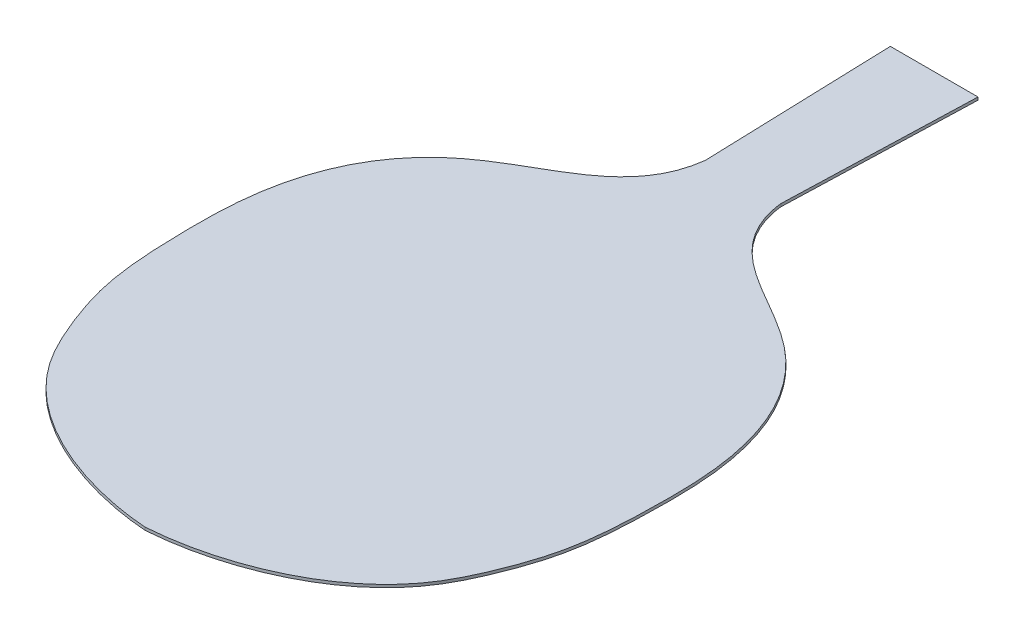
ISO-10303-21;
HEADER;
FILE_DESCRIPTION(('STEP AP214'),'2;1');
FILE_NAME('part.step','',(''),(''),'','','');
FILE_SCHEMA(('AUTOMOTIVE_DESIGN { 1 0 10303 214 1 1 1 1 }'));
ENDSEC;
DATA;
#1=APPLICATION_CONTEXT('core data for automotive mechanical design processes');
#2=APPLICATION_PROTOCOL_DEFINITION('international standard','automotive_design',2000,#1);
#3=PRODUCT_CONTEXT('',#1,'mechanical');
#4=PRODUCT('Part','Part','',(#3));
#5=PRODUCT_RELATED_PRODUCT_CATEGORY('part','',(#4));
#6=PRODUCT_DEFINITION_FORMATION('','',#4);
#7=PRODUCT_DEFINITION_CONTEXT('part definition',#1,'design');
#8=PRODUCT_DEFINITION('design','',#6,#7);
#9=PRODUCT_DEFINITION_SHAPE('','',#8);
#10=(LENGTH_UNIT() NAMED_UNIT(*) SI_UNIT(.MILLI.,.METRE.));
#11=(NAMED_UNIT(*) PLANE_ANGLE_UNIT() SI_UNIT($,.RADIAN.));
#12=(NAMED_UNIT(*) SI_UNIT($,.STERADIAN.) SOLID_ANGLE_UNIT());
#13=UNCERTAINTY_MEASURE_WITH_UNIT(LENGTH_MEASURE(1.E-05),#10,'distance_accuracy_value','');
#14=(GEOMETRIC_REPRESENTATION_CONTEXT(3) GLOBAL_UNCERTAINTY_ASSIGNED_CONTEXT((#13)) GLOBAL_UNIT_ASSIGNED_CONTEXT((#10,
#11,#12)) REPRESENTATION_CONTEXT('',''));
#15=CARTESIAN_POINT('',(0.,0.,0.));
#16=DIRECTION('',(0.,0.,1.));
#17=DIRECTION('',(1.,0.,0.));
#18=AXIS2_PLACEMENT_3D('',#15,#16,#17);
#19=CARTESIAN_POINT('',(-14.,0.9,-126.));
#20=DIRECTION('',(0.999468760107714,0.,-0.0325913726122081));
#21=DIRECTION('',(-0.0325913726122081,0.,-0.999468760107715));
#22=AXIS2_PLACEMENT_3D('',#19,#20,#21);
#23=PLANE('',#22);
#24=DIRECTION('',(0.0325913726122081,0.,0.999468760107714));
#25=VECTOR('',#24,1.);
#26=CARTESIAN_POINT('',(-14.,0.,-126.));
#27=LINE('',#26,#25);
#28=CARTESIAN_POINT('',(-14.,0.,-126.));
#29=VERTEX_POINT('',#28);
#30=CARTESIAN_POINT('',(-12.0108695652174,0.,-65.0000000000001));
#31=VERTEX_POINT('',#30);
#32=EDGE_CURVE('E122',#29,#31,#27,.T.);
#33=ORIENTED_EDGE('',*,*,#32,.T.);
#34=DIRECTION('',(0.,-1.,0.));
#35=VECTOR('',#34,1.);
#36=CARTESIAN_POINT('',(-12.0108695652174,0.9,-65.0000000000001));
#37=LINE('',#36,#35);
#38=CARTESIAN_POINT('',(-12.0108695652174,0.9,-65.0000000000001));
#39=VERTEX_POINT('',#38);
#40=EDGE_CURVE('E11',#39,#31,#37,.T.);
#41=ORIENTED_EDGE('',*,*,#40,.F.);
#42=DIRECTION('',(0.0325913726122081,0.,0.999468760107714));
#43=VECTOR('',#42,1.);
#44=CARTESIAN_POINT('',(-14.,0.9,-126.));
#45=LINE('',#44,#43);
#46=CARTESIAN_POINT('',(-14.,0.9,-126.));
#47=VERTEX_POINT('',#46);
#48=EDGE_CURVE('E144',#47,#39,#45,.T.);
#49=ORIENTED_EDGE('',*,*,#48,.F.);
#50=DIRECTION('',(0.,-1.,0.));
#51=VECTOR('',#50,1.);
#52=CARTESIAN_POINT('',(-14.,0.9,-126.));
#53=LINE('',#52,#51);
#54=EDGE_CURVE('E115',#47,#29,#53,.T.);
#55=ORIENTED_EDGE('',*,*,#54,.T.);
#56=EDGE_LOOP('',(#33,#41,#49,#55));
#57=FACE_BOUND('',#56,.T.);
#58=ADVANCED_FACE('F40',(#57),#23,.F.);
#59=CARTESIAN_POINT('',(-12.0108695652174,0.9,-65.0000000000001));
#60=CARTESIAN_POINT('',(-14.0285781259503,0.9,-47.8847798042941));
#61=CARTESIAN_POINT('',(-32.9501995306982,0.9,-38.6407589320184));
#62=CARTESIAN_POINT('',(-55.542429665009,0.9,-24.4759384340318));
#63=CARTESIAN_POINT('',(-68.9521229487818,0.9,-7.61282204708139));
#64=CARTESIAN_POINT('',(-75.6405828411107,0.9,15.5273599862506));
#65=CARTESIAN_POINT('',(-75.7438976186742,0.9,41.0029819512427));
#66=CARTESIAN_POINT('',(-74.5463890900623,0.9,63.145782755751));
#67=CARTESIAN_POINT('',(-68.3531160658641,0.9,81.4392813935087));
#68=CARTESIAN_POINT('',(-53.8143360130552,0.9,112.472945485415));
#69=CARTESIAN_POINT('',(-21.433619384809,0.9,124.48189106939));
#70=CARTESIAN_POINT('',(0.,0.9,126.));
#71=B_SPLINE_CURVE_WITH_KNOTS('',3,(#59,#60,#61,#62,#63,#64,#65,#66,#67,#68,#69,#70),
.UNSPECIFIED.,.F.,.F.,(4,1,1,1,1,1,1,1,1,4),(0.,0.166997829032324,0.235295440099185,
0.309779407450195,0.411558653386311,0.508573183513764,0.605993674392942,0.667061221954611,
0.732439038137642,1.),.UNSPECIFIED.);
#72=DIRECTION('',(0.,-1.,0.));
#73=VECTOR('',#72,1.);
#74=SURFACE_OF_LINEAR_EXTRUSION('',#71,#73);
#75=CARTESIAN_POINT('',(-12.0108695652174,0.,-65.0000000000001));
#76=CARTESIAN_POINT('',(-14.0285781259503,0.,-47.8847798042941));
#77=CARTESIAN_POINT('',(-32.9501995306982,0.,-38.6407589320184));
#78=CARTESIAN_POINT('',(-55.542429665009,0.,-24.4759384340318));
#79=CARTESIAN_POINT('',(-68.9521229487818,0.,-7.61282204708139));
#80=CARTESIAN_POINT('',(-75.6405828411107,0.,15.5273599862506));
#81=CARTESIAN_POINT('',(-75.7438976186742,0.,41.0029819512427));
#82=CARTESIAN_POINT('',(-74.5463890900623,0.,63.145782755751));
#83=CARTESIAN_POINT('',(-68.3531160658641,0.,81.4392813935087));
#84=CARTESIAN_POINT('',(-53.8143360130552,0.,112.472945485415));
#85=CARTESIAN_POINT('',(-21.433619384809,0.,124.48189106939));
#86=CARTESIAN_POINT('',(0.,0.,126.));
#87=B_SPLINE_CURVE_WITH_KNOTS('',3,(#75,#76,#77,#78,#79,#80,#81,#82,#83,#84,#85,#86),
.UNSPECIFIED.,.F.,.F.,(4,1,1,1,1,1,1,1,1,4),(0.,0.166997829032324,0.235295440099185,
0.309779407450195,0.411558653386311,0.508573183513764,0.605993674392942,0.667061221954611,
0.732439038137642,1.),.UNSPECIFIED.);
#88=CARTESIAN_POINT('',(0.,0.,126.));
#89=VERTEX_POINT('',#88);
#90=EDGE_CURVE('E126',#31,#89,#87,.T.);
#91=ORIENTED_EDGE('',*,*,#90,.T.);
#92=DIRECTION('',(0.,-1.,0.));
#93=VECTOR('',#92,1.);
#94=CARTESIAN_POINT('',(0.,0.9,126.));
#95=LINE('',#94,#93);
#96=CARTESIAN_POINT('',(0.,0.9,126.));
#97=VERTEX_POINT('',#96);
#98=EDGE_CURVE('E49',#97,#89,#95,.T.);
#99=ORIENTED_EDGE('',*,*,#98,.F.);
#100=EDGE_CURVE('E93',#39,#97,#71,.T.);
#101=ORIENTED_EDGE('',*,*,#100,.F.);
#102=ORIENTED_EDGE('',*,*,#40,.T.);
#103=EDGE_LOOP('',(#91,#99,#101,#102));
#104=FACE_BOUND('',#103,.T.);
#105=ADVANCED_FACE('F163',(#104),#74,.F.);
#106=CARTESIAN_POINT('',(0.,0.9,126.));
#107=CARTESIAN_POINT('',(21.433619384809,0.9,124.48189106939));
#108=CARTESIAN_POINT('',(53.8143360130551,0.9,112.472945485415));
#109=CARTESIAN_POINT('',(68.3531160658641,0.9,81.4392813935086));
#110=CARTESIAN_POINT('',(74.5463890900623,0.9,63.145782755751));
#111=CARTESIAN_POINT('',(75.7438976186741,0.9,41.0029819512426));
#112=CARTESIAN_POINT('',(75.6405828411107,0.9,15.5273599862506));
#113=CARTESIAN_POINT('',(68.9521229487818,0.9,-7.61282204708139));
#114=CARTESIAN_POINT('',(55.542429665009,0.9,-24.4759384340318));
#115=CARTESIAN_POINT('',(32.9501995306981,0.9,-38.6407589320184));
#116=CARTESIAN_POINT('',(14.0285781259503,0.9,-47.8847798042942));
#117=CARTESIAN_POINT('',(12.0108695652174,0.9,-65.0000000000001));
#118=B_SPLINE_CURVE_WITH_KNOTS('',3,(#106,#107,#108,#109,#110,#111,#112,#113,#114,#115,#116,
#117),.UNSPECIFIED.,.F.,.F.,(4,1,1,1,1,1,1,1,1,4),(0.,0.267560961862358,0.332938778045389,
0.394006325607058,0.491426816486236,0.588441346613689,0.690220592549805,0.764704559900815,
0.833002170967676,1.),.UNSPECIFIED.);
#119=DIRECTION('',(0.,-1.,0.));
#120=VECTOR('',#119,1.);
#121=SURFACE_OF_LINEAR_EXTRUSION('',#118,#120);
#122=CARTESIAN_POINT('',(0.,0.,126.));
#123=CARTESIAN_POINT('',(21.433619384809,0.,124.48189106939));
#124=CARTESIAN_POINT('',(53.8143360130551,0.,112.472945485415));
#125=CARTESIAN_POINT('',(68.3531160658641,0.,81.4392813935086));
#126=CARTESIAN_POINT('',(74.5463890900623,0.,63.145782755751));
#127=CARTESIAN_POINT('',(75.7438976186741,0.,41.0029819512426));
#128=CARTESIAN_POINT('',(75.6405828411107,0.,15.5273599862506));
#129=CARTESIAN_POINT('',(68.9521229487818,0.,-7.61282204708139));
#130=CARTESIAN_POINT('',(55.542429665009,0.,-24.4759384340318));
#131=CARTESIAN_POINT('',(32.9501995306981,0.,-38.6407589320184));
#132=CARTESIAN_POINT('',(14.0285781259503,0.,-47.8847798042942));
#133=CARTESIAN_POINT('',(12.0108695652174,0.,-65.0000000000001));
#134=B_SPLINE_CURVE_WITH_KNOTS('',3,(#122,#123,#124,#125,#126,#127,#128,#129,#130,#131,#132,
#133),.UNSPECIFIED.,.F.,.F.,(4,1,1,1,1,1,1,1,1,4),(0.,0.267560961862358,0.332938778045389,
0.394006325607058,0.491426816486236,0.588441346613689,0.690220592549805,0.764704559900815,
0.833002170967676,1.),.UNSPECIFIED.);
#135=CARTESIAN_POINT('',(12.0108695652174,0.,-65.0000000000001));
#136=VERTEX_POINT('',#135);
#137=EDGE_CURVE('E109',#89,#136,#134,.T.);
#138=ORIENTED_EDGE('',*,*,#137,.T.);
#139=DIRECTION('',(0.,-1.,0.));
#140=VECTOR('',#139,1.);
#141=CARTESIAN_POINT('',(12.0108695652174,0.9,-65.0000000000001));
#142=LINE('',#141,#140);
#143=CARTESIAN_POINT('',(12.0108695652174,0.9,-65.0000000000001));
#144=VERTEX_POINT('',#143);
#145=EDGE_CURVE('E106',#144,#136,#142,.T.);
#146=ORIENTED_EDGE('',*,*,#145,.F.);
#147=EDGE_CURVE('E97',#97,#144,#118,.T.);
#148=ORIENTED_EDGE('',*,*,#147,.F.);
#149=ORIENTED_EDGE('',*,*,#98,.T.);
#150=EDGE_LOOP('',(#138,#146,#148,#149));
#151=FACE_BOUND('',#150,.T.);
#152=ADVANCED_FACE('F107',(#151),#121,.F.);
#153=CARTESIAN_POINT('',(14.,0.9,-126.));
#154=DIRECTION('',(-0.999468760107714,0.,-0.0325913726122081));
#155=DIRECTION('',(-0.0325913726122081,0.,0.999468760107715));
#156=AXIS2_PLACEMENT_3D('',#153,#154,#155);
#157=PLANE('',#156);
#158=DIRECTION('',(0.0325913726122081,0.,-0.999468760107714));
#159=VECTOR('',#158,1.);
#160=CARTESIAN_POINT('',(14.,0.,-126.));
#161=LINE('',#160,#159);
#162=CARTESIAN_POINT('',(14.,0.,-126.));
#163=VERTEX_POINT('',#162);
#164=EDGE_CURVE('E78',#136,#163,#161,.T.);
#165=ORIENTED_EDGE('',*,*,#164,.T.);
#166=DIRECTION('',(0.,-1.,0.));
#167=VECTOR('',#166,1.);
#168=CARTESIAN_POINT('',(14.,0.9,-126.));
#169=LINE('',#168,#167);
#170=CARTESIAN_POINT('',(14.,0.9,-126.));
#171=VERTEX_POINT('',#170);
#172=EDGE_CURVE('E110',#171,#163,#169,.T.);
#173=ORIENTED_EDGE('',*,*,#172,.F.);
#174=DIRECTION('',(0.0325913726122081,0.,-0.999468760107714));
#175=VECTOR('',#174,1.);
#176=CARTESIAN_POINT('',(14.,0.9,-126.));
#177=LINE('',#176,#175);
#178=EDGE_CURVE('E101',#144,#171,#177,.T.);
#179=ORIENTED_EDGE('',*,*,#178,.F.);
#180=ORIENTED_EDGE('',*,*,#145,.T.);
#181=EDGE_LOOP('',(#165,#173,#179,#180));
#182=FACE_BOUND('',#181,.T.);
#183=ADVANCED_FACE('F112',(#182),#157,.F.);
#184=CARTESIAN_POINT('',(-14.,0.9,-126.));
#185=DIRECTION('',(0.,0.,1.));
#186=DIRECTION('',(1.,0.,0.));
#187=AXIS2_PLACEMENT_3D('',#184,#185,#186);
#188=PLANE('',#187);
#189=DIRECTION('',(-1.,0.,0.));
#190=VECTOR('',#189,1.);
#191=CARTESIAN_POINT('',(-14.,0.,-126.));
#192=LINE('',#191,#190);
#193=EDGE_CURVE('E84',#163,#29,#192,.T.);
#194=ORIENTED_EDGE('',*,*,#193,.T.);
#195=ORIENTED_EDGE('',*,*,#54,.F.);
#196=DIRECTION('',(-1.,0.,0.));
#197=VECTOR('',#196,1.);
#198=CARTESIAN_POINT('',(-14.,0.9,-126.));
#199=LINE('',#198,#197);
#200=EDGE_CURVE('E57',#171,#47,#199,.T.);
#201=ORIENTED_EDGE('',*,*,#200,.F.);
#202=ORIENTED_EDGE('',*,*,#172,.T.);
#203=EDGE_LOOP('',(#194,#195,#201,#202));
#204=FACE_BOUND('',#203,.T.);
#205=ADVANCED_FACE('F152',(#204),#188,.F.);
#206=CARTESIAN_POINT('',(-75.5493209399057,0.9,38.7803187541172));
#207=DIRECTION('',(0.,1.,0.));
#208=DIRECTION('',(0.,0.,1.));
#209=AXIS2_PLACEMENT_3D('',#206,#207,#208);
#210=PLANE('',#209);
#211=ORIENTED_EDGE('',*,*,#48,.T.);
#212=ORIENTED_EDGE('',*,*,#100,.T.);
#213=ORIENTED_EDGE('',*,*,#147,.T.);
#214=ORIENTED_EDGE('',*,*,#178,.T.);
#215=ORIENTED_EDGE('',*,*,#200,.T.);
#216=EDGE_LOOP('',(#211,#212,#213,#214,#215));
#217=FACE_BOUND('',#216,.T.);
#218=ADVANCED_FACE('F99',(#217),#210,.T.);
#219=CARTESIAN_POINT('',(-75.5493209399057,0.,38.7803187541172));
#220=DIRECTION('',(0.,1.,0.));
#221=DIRECTION('',(0.,0.,1.));
#222=AXIS2_PLACEMENT_3D('',#219,#220,#221);
#223=PLANE('',#222);
#224=ORIENTED_EDGE('',*,*,#32,.F.);
#225=ORIENTED_EDGE('',*,*,#193,.F.);
#226=ORIENTED_EDGE('',*,*,#164,.F.);
#227=ORIENTED_EDGE('',*,*,#137,.F.);
#228=ORIENTED_EDGE('',*,*,#90,.F.);
#229=EDGE_LOOP('',(#224,#225,#226,#227,#228));
#230=FACE_BOUND('',#229,.T.);
#231=ADVANCED_FACE('F148',(#230),#223,.F.);
#232=CLOSED_SHELL('',(#58,#105,#152,#183,#205,#218,#231));
#233=MANIFOLD_SOLID_BREP('B2',#232);
#234=ADVANCED_BREP_SHAPE_REPRESENTATION('',(#18,#233),#14);
#235=SHAPE_DEFINITION_REPRESENTATION(#9,#234);
ENDSEC;
END-ISO-10303-21;
